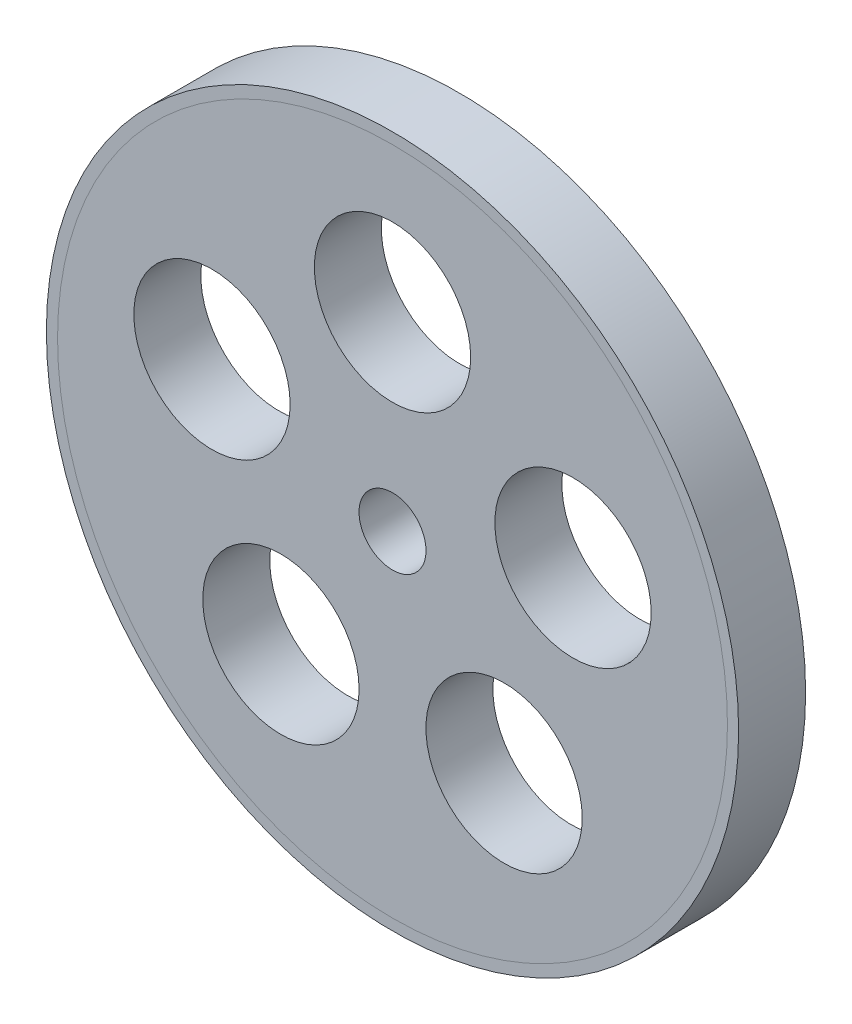
ISO-10303-21;
HEADER;
FILE_DESCRIPTION(('STEP AP214'),'2;1');
FILE_NAME('part.step','',(''),(''),'','','');
FILE_SCHEMA(('AUTOMOTIVE_DESIGN { 1 0 10303 214 1 1 1 1 }'));
ENDSEC;
DATA;
#1=APPLICATION_CONTEXT('core data for automotive mechanical design processes');
#2=APPLICATION_PROTOCOL_DEFINITION('international standard','automotive_design',2000,#1);
#3=PRODUCT_CONTEXT('',#1,'mechanical');
#4=PRODUCT('Part','Part','',(#3));
#5=PRODUCT_RELATED_PRODUCT_CATEGORY('part','',(#4));
#6=PRODUCT_DEFINITION_FORMATION('','',#4);
#7=PRODUCT_DEFINITION_CONTEXT('part definition',#1,'design');
#8=PRODUCT_DEFINITION('design','',#6,#7);
#9=PRODUCT_DEFINITION_SHAPE('','',#8);
#10=(LENGTH_UNIT() NAMED_UNIT(*) SI_UNIT(.MILLI.,.METRE.));
#11=(NAMED_UNIT(*) PLANE_ANGLE_UNIT() SI_UNIT($,.RADIAN.));
#12=(NAMED_UNIT(*) SI_UNIT($,.STERADIAN.) SOLID_ANGLE_UNIT());
#13=UNCERTAINTY_MEASURE_WITH_UNIT(LENGTH_MEASURE(1.E-05),#10,'distance_accuracy_value','');
#14=(GEOMETRIC_REPRESENTATION_CONTEXT(3) GLOBAL_UNCERTAINTY_ASSIGNED_CONTEXT((#13)) GLOBAL_UNIT_ASSIGNED_CONTEXT((#10,
#11,#12)) REPRESENTATION_CONTEXT('',''));
#15=CARTESIAN_POINT('',(0.,0.,0.));
#16=DIRECTION('',(0.,0.,1.));
#17=DIRECTION('',(1.,0.,0.));
#18=AXIS2_PLACEMENT_3D('',#15,#16,#17);
#19=CARTESIAN_POINT('',(0.,0.,0.));
#20=DIRECTION('',(0.,0.,-1.));
#21=DIRECTION('',(-1.,0.,0.));
#22=AXIS2_PLACEMENT_3D('',#19,#20,#21);
#23=CYLINDRICAL_SURFACE('',#22,15.);
#24=CARTESIAN_POINT('',(0.,0.,0.));
#25=DIRECTION('',(0.,0.,-1.));
#26=DIRECTION('',(-1.,0.,0.));
#27=AXIS2_PLACEMENT_3D('',#24,#25,#26);
#28=CIRCLE('',#27,15.);
#29=CARTESIAN_POINT('',(-15.,0.,0.));
#30=VERTEX_POINT('',#29);
#31=EDGE_CURVE('E59',#30,#30,#28,.T.);
#32=ORIENTED_EDGE('',*,*,#31,.T.);
#33=EDGE_LOOP('',(#32));
#34=FACE_BOUND('',#33,.T.);
#35=CARTESIAN_POINT('',(0.,0.,3.));
#36=DIRECTION('',(0.,0.,-1.));
#37=DIRECTION('',(-1.,0.,0.));
#38=AXIS2_PLACEMENT_3D('',#35,#36,#37);
#39=CIRCLE('',#38,15.);
#40=CARTESIAN_POINT('',(-15.,0.,3.));
#41=VERTEX_POINT('',#40);
#42=EDGE_CURVE('E11',#41,#41,#39,.T.);
#43=ORIENTED_EDGE('',*,*,#42,.F.);
#44=EDGE_LOOP('',(#43));
#45=FACE_BOUND('',#44,.T.);
#46=ADVANCED_FACE('F45',(#34,#45),#23,.F.);
#47=CARTESIAN_POINT('',(-15.,0.,3.));
#48=DIRECTION('',(0.,0.,1.));
#49=DIRECTION('',(1.,0.,0.));
#50=AXIS2_PLACEMENT_3D('',#47,#48,#49);
#51=PLANE('',#50);
#52=ORIENTED_EDGE('',*,*,#42,.T.);
#53=EDGE_LOOP('',(#52));
#54=FACE_BOUND('',#53,.T.);
#55=CARTESIAN_POINT('',(0.,0.,3.));
#56=DIRECTION('',(0.,0.,-1.));
#57=DIRECTION('',(-1.,0.,0.));
#58=AXIS2_PLACEMENT_3D('',#55,#56,#57);
#59=CIRCLE('',#58,15.5);
#60=CARTESIAN_POINT('',(-15.5,0.,3.));
#61=VERTEX_POINT('',#60);
#62=EDGE_CURVE('E51',#61,#61,#59,.T.);
#63=ORIENTED_EDGE('',*,*,#62,.F.);
#64=EDGE_LOOP('',(#63));
#65=FACE_BOUND('',#64,.T.);
#66=ADVANCED_FACE('F75',(#54,#65),#51,.T.);
#67=CARTESIAN_POINT('',(0.,0.,0.));
#68=DIRECTION('',(0.,0.,-1.));
#69=DIRECTION('',(-1.,0.,0.));
#70=AXIS2_PLACEMENT_3D('',#67,#68,#69);
#71=CYLINDRICAL_SURFACE('',#70,15.5);
#72=ORIENTED_EDGE('',*,*,#62,.T.);
#73=EDGE_LOOP('',(#72));
#74=FACE_BOUND('',#73,.T.);
#75=CARTESIAN_POINT('',(0.,0.,0.));
#76=DIRECTION('',(0.,0.,-1.));
#77=DIRECTION('',(-1.,0.,0.));
#78=AXIS2_PLACEMENT_3D('',#75,#76,#77);
#79=CIRCLE('',#78,15.5);
#80=CARTESIAN_POINT('',(-15.5,0.,0.));
#81=VERTEX_POINT('',#80);
#82=EDGE_CURVE('E55',#81,#81,#79,.T.);
#83=ORIENTED_EDGE('',*,*,#82,.F.);
#84=EDGE_LOOP('',(#83));
#85=FACE_BOUND('',#84,.T.);
#86=ADVANCED_FACE('F69',(#74,#85),#71,.T.);
#87=CARTESIAN_POINT('',(-15.,0.,0.));
#88=DIRECTION('',(0.,0.,-1.));
#89=DIRECTION('',(-1.,0.,0.));
#90=AXIS2_PLACEMENT_3D('',#87,#88,#89);
#91=PLANE('',#90);
#92=ORIENTED_EDGE('',*,*,#82,.T.);
#93=EDGE_LOOP('',(#92));
#94=FACE_BOUND('',#93,.T.);
#95=ORIENTED_EDGE('',*,*,#31,.F.);
#96=EDGE_LOOP('',(#95));
#97=FACE_BOUND('',#96,.T.);
#98=ADVANCED_FACE('F67',(#94,#97),#91,.T.);
#99=CLOSED_SHELL('',(#46,#66,#86,#98));
#100=MANIFOLD_SOLID_BREP('B2',#99);
#101=CARTESIAN_POINT('',(0.,0.,3.));
#102=DIRECTION('',(0.,0.,1.));
#103=DIRECTION('',(1.,0.,0.));
#104=AXIS2_PLACEMENT_3D('',#101,#102,#103);
#105=PLANE('',#104);
#106=CARTESIAN_POINT('',(4.99617464448831,-6.87664445218631,3.));
#107=DIRECTION('',(0.,0.,1.));
#108=DIRECTION('',(1.,0.,0.));
#109=AXIS2_PLACEMENT_3D('',#106,#107,#108);
#110=CIRCLE('',#109,3.50000000000202);
#111=CARTESIAN_POINT('',(8.49617464449033,-6.87664445218631,3.));
#112=VERTEX_POINT('',#111);
#113=EDGE_CURVE('E125',#112,#112,#110,.T.);
#114=ORIENTED_EDGE('',*,*,#113,.F.);
#115=EDGE_LOOP('',(#114));
#116=FACE_BOUND('',#115,.T.);
#117=CARTESIAN_POINT('',(-4.99617464448373,-6.8766444521878,3.));
#118=DIRECTION('',(0.,0.,1.));
#119=DIRECTION('',(1.,0.,0.));
#120=AXIS2_PLACEMENT_3D('',#117,#118,#119);
#121=CIRCLE('',#120,3.50000000000248);
#122=CARTESIAN_POINT('',(-1.49617464448125,-6.8766444521878,3.));
#123=VERTEX_POINT('',#122);
#124=EDGE_CURVE('E132',#123,#123,#121,.T.);
#125=ORIENTED_EDGE('',*,*,#124,.F.);
#126=EDGE_LOOP('',(#125));
#127=FACE_BOUND('',#126,.T.);
#128=CARTESIAN_POINT('',(-8.08398038850793,2.62664445218585,3.));
#129=DIRECTION('',(0.,0.,1.));
#130=DIRECTION('',(1.,0.,0.));
#131=AXIS2_PLACEMENT_3D('',#128,#129,#130);
#132=CIRCLE('',#131,3.50000000000128);
#133=CARTESIAN_POINT('',(-4.58398038850665,2.62664445218585,3.));
#134=VERTEX_POINT('',#133);
#135=EDGE_CURVE('E136',#134,#134,#132,.T.);
#136=ORIENTED_EDGE('',*,*,#135,.F.);
#137=EDGE_LOOP('',(#136));
#138=FACE_BOUND('',#137,.T.);
#139=CARTESIAN_POINT('',(0.,8.5,3.));
#140=DIRECTION('',(0.,0.,1.));
#141=DIRECTION('',(1.,0.,0.));
#142=AXIS2_PLACEMENT_3D('',#139,#140,#141);
#143=CIRCLE('',#142,3.5);
#144=CARTESIAN_POINT('',(3.5,8.5,3.));
#145=VERTEX_POINT('',#144);
#146=EDGE_CURVE('E140',#145,#145,#143,.T.);
#147=ORIENTED_EDGE('',*,*,#146,.F.);
#148=EDGE_LOOP('',(#147));
#149=FACE_BOUND('',#148,.T.);
#150=CARTESIAN_POINT('',(8.08398038850968,2.62664445218826,3.));
#151=DIRECTION('',(0.,0.,1.));
#152=DIRECTION('',(1.,0.,0.));
#153=AXIS2_PLACEMENT_3D('',#150,#151,#152);
#154=CIRCLE('',#153,3.50000000000051);
#155=CARTESIAN_POINT('',(11.5839803885102,2.62664445218826,3.));
#156=VERTEX_POINT('',#155);
#157=EDGE_CURVE('E144',#156,#156,#154,.T.);
#158=ORIENTED_EDGE('',*,*,#157,.F.);
#159=EDGE_LOOP('',(#158));
#160=FACE_BOUND('',#159,.T.);
#161=CARTESIAN_POINT('',(0.,0.,3.));
#162=DIRECTION('',(0.,0.,1.));
#163=DIRECTION('',(1.,0.,0.));
#164=AXIS2_PLACEMENT_3D('',#161,#162,#163);
#165=CIRCLE('',#164,15.);
#166=CARTESIAN_POINT('',(15.,0.,3.));
#167=VERTEX_POINT('',#166);
#168=EDGE_CURVE('E44',#167,#167,#165,.T.);
#169=ORIENTED_EDGE('',*,*,#168,.T.);
#170=EDGE_LOOP('',(#169));
#171=FACE_BOUND('',#170,.T.);
#172=CARTESIAN_POINT('',(0.,0.,3.));
#173=DIRECTION('',(0.,0.,1.));
#174=DIRECTION('',(1.,0.,0.));
#175=AXIS2_PLACEMENT_3D('',#172,#173,#174);
#176=CIRCLE('',#175,1.5);
#177=CARTESIAN_POINT('',(1.5,0.,3.));
#178=VERTEX_POINT('',#177);
#179=EDGE_CURVE('E119',#178,#178,#176,.T.);
#180=ORIENTED_EDGE('',*,*,#179,.F.);
#181=EDGE_LOOP('',(#180));
#182=FACE_BOUND('',#181,.T.);
#183=ADVANCED_FACE('F106',(#116,#127,#138,#149,#160,#171,#182),#105,.T.);
#184=CARTESIAN_POINT('',(0.,0.,0.));
#185=DIRECTION('',(0.,0.,1.));
#186=DIRECTION('',(1.,0.,0.));
#187=AXIS2_PLACEMENT_3D('',#184,#185,#186);
#188=PLANE('',#187);
#189=CARTESIAN_POINT('',(4.99617464448831,-6.87664445218631,0.));
#190=DIRECTION('',(0.,0.,1.));
#191=DIRECTION('',(1.,0.,0.));
#192=AXIS2_PLACEMENT_3D('',#189,#190,#191);
#193=CIRCLE('',#192,3.50000000000202);
#194=CARTESIAN_POINT('',(8.49617464449033,-6.87664445218631,0.));
#195=VERTEX_POINT('',#194);
#196=EDGE_CURVE('E153',#195,#195,#193,.T.);
#197=ORIENTED_EDGE('',*,*,#196,.T.);
#198=EDGE_LOOP('',(#197));
#199=FACE_BOUND('',#198,.T.);
#200=CARTESIAN_POINT('',(-4.99617464448373,-6.8766444521878,0.));
#201=DIRECTION('',(0.,0.,1.));
#202=DIRECTION('',(1.,0.,0.));
#203=AXIS2_PLACEMENT_3D('',#200,#201,#202);
#204=CIRCLE('',#203,3.50000000000248);
#205=CARTESIAN_POINT('',(-1.49617464448125,-6.8766444521878,0.));
#206=VERTEX_POINT('',#205);
#207=EDGE_CURVE('E157',#206,#206,#204,.T.);
#208=ORIENTED_EDGE('',*,*,#207,.T.);
#209=EDGE_LOOP('',(#208));
#210=FACE_BOUND('',#209,.T.);
#211=CARTESIAN_POINT('',(-8.08398038850793,2.62664445218585,0.));
#212=DIRECTION('',(0.,0.,1.));
#213=DIRECTION('',(1.,0.,0.));
#214=AXIS2_PLACEMENT_3D('',#211,#212,#213);
#215=CIRCLE('',#214,3.50000000000128);
#216=CARTESIAN_POINT('',(-4.58398038850665,2.62664445218585,0.));
#217=VERTEX_POINT('',#216);
#218=EDGE_CURVE('E161',#217,#217,#215,.T.);
#219=ORIENTED_EDGE('',*,*,#218,.T.);
#220=EDGE_LOOP('',(#219));
#221=FACE_BOUND('',#220,.T.);
#222=CARTESIAN_POINT('',(0.,8.5,0.));
#223=DIRECTION('',(0.,0.,1.));
#224=DIRECTION('',(1.,0.,0.));
#225=AXIS2_PLACEMENT_3D('',#222,#223,#224);
#226=CIRCLE('',#225,3.5);
#227=CARTESIAN_POINT('',(3.5,8.5,0.));
#228=VERTEX_POINT('',#227);
#229=EDGE_CURVE('E152',#228,#228,#226,.T.);
#230=ORIENTED_EDGE('',*,*,#229,.T.);
#231=EDGE_LOOP('',(#230));
#232=FACE_BOUND('',#231,.T.);
#233=CARTESIAN_POINT('',(8.08398038850968,2.62664445218826,0.));
#234=DIRECTION('',(0.,0.,1.));
#235=DIRECTION('',(1.,0.,0.));
#236=AXIS2_PLACEMENT_3D('',#233,#234,#235);
#237=CIRCLE('',#236,3.50000000000051);
#238=CARTESIAN_POINT('',(11.5839803885102,2.62664445218826,0.));
#239=VERTEX_POINT('',#238);
#240=EDGE_CURVE('E148',#239,#239,#237,.T.);
#241=ORIENTED_EDGE('',*,*,#240,.T.);
#242=EDGE_LOOP('',(#241));
#243=FACE_BOUND('',#242,.T.);
#244=CARTESIAN_POINT('',(0.,0.,0.));
#245=DIRECTION('',(0.,0.,1.));
#246=DIRECTION('',(1.,0.,0.));
#247=AXIS2_PLACEMENT_3D('',#244,#245,#246);
#248=CIRCLE('',#247,15.);
#249=CARTESIAN_POINT('',(15.,0.,0.));
#250=VERTEX_POINT('',#249);
#251=EDGE_CURVE('E110',#250,#250,#248,.T.);
#252=ORIENTED_EDGE('',*,*,#251,.F.);
#253=EDGE_LOOP('',(#252));
#254=FACE_BOUND('',#253,.T.);
#255=CARTESIAN_POINT('',(0.,0.,0.));
#256=DIRECTION('',(0.,0.,1.));
#257=DIRECTION('',(1.,0.,0.));
#258=AXIS2_PLACEMENT_3D('',#255,#256,#257);
#259=CIRCLE('',#258,1.5);
#260=CARTESIAN_POINT('',(1.5,0.,0.));
#261=VERTEX_POINT('',#260);
#262=EDGE_CURVE('E121',#261,#261,#259,.T.);
#263=ORIENTED_EDGE('',*,*,#262,.T.);
#264=EDGE_LOOP('',(#263));
#265=FACE_BOUND('',#264,.T.);
#266=ADVANCED_FACE('F169',(#199,#210,#221,#232,#243,#254,#265),#188,.F.);
#267=CARTESIAN_POINT('',(0.,0.,3.));
#268=DIRECTION('',(0.,0.,-1.));
#269=DIRECTION('',(-1.,0.,0.));
#270=AXIS2_PLACEMENT_3D('',#267,#268,#269);
#271=CYLINDRICAL_SURFACE('',#270,15.);
#272=ORIENTED_EDGE('',*,*,#168,.F.);
#273=EDGE_LOOP('',(#272));
#274=FACE_BOUND('',#273,.T.);
#275=ORIENTED_EDGE('',*,*,#251,.T.);
#276=EDGE_LOOP('',(#275));
#277=FACE_BOUND('',#276,.T.);
#278=ADVANCED_FACE('F108',(#274,#277),#271,.T.);
#279=CARTESIAN_POINT('',(0.,0.,3.));
#280=DIRECTION('',(0.,0.,-1.));
#281=DIRECTION('',(-1.,0.,0.));
#282=AXIS2_PLACEMENT_3D('',#279,#280,#281);
#283=CYLINDRICAL_SURFACE('',#282,1.5);
#284=ORIENTED_EDGE('',*,*,#179,.T.);
#285=EDGE_LOOP('',(#284));
#286=FACE_BOUND('',#285,.T.);
#287=ORIENTED_EDGE('',*,*,#262,.F.);
#288=EDGE_LOOP('',(#287));
#289=FACE_BOUND('',#288,.T.);
#290=ADVANCED_FACE('F185',(#286,#289),#283,.F.);
#291=CARTESIAN_POINT('',(8.08398038850968,2.62664445218826,0.));
#292=DIRECTION('',(0.,0.,1.));
#293=DIRECTION('',(1.,0.,0.));
#294=AXIS2_PLACEMENT_3D('',#291,#292,#293);
#295=CYLINDRICAL_SURFACE('',#294,3.50000000000051);
#296=ORIENTED_EDGE('',*,*,#157,.T.);
#297=EDGE_LOOP('',(#296));
#298=FACE_BOUND('',#297,.T.);
#299=ORIENTED_EDGE('',*,*,#240,.F.);
#300=EDGE_LOOP('',(#299));
#301=FACE_BOUND('',#300,.T.);
#302=ADVANCED_FACE('F175',(#298,#301),#295,.F.);
#303=CARTESIAN_POINT('',(0.,8.5,0.));
#304=DIRECTION('',(0.,0.,1.));
#305=DIRECTION('',(1.,0.,0.));
#306=AXIS2_PLACEMENT_3D('',#303,#304,#305);
#307=CYLINDRICAL_SURFACE('',#306,3.5);
#308=ORIENTED_EDGE('',*,*,#146,.T.);
#309=EDGE_LOOP('',(#308));
#310=FACE_BOUND('',#309,.T.);
#311=ORIENTED_EDGE('',*,*,#229,.F.);
#312=EDGE_LOOP('',(#311));
#313=FACE_BOUND('',#312,.T.);
#314=ADVANCED_FACE('F172',(#310,#313),#307,.F.);
#315=CARTESIAN_POINT('',(-8.08398038850793,2.62664445218585,0.));
#316=DIRECTION('',(0.,0.,1.));
#317=DIRECTION('',(1.,0.,0.));
#318=AXIS2_PLACEMENT_3D('',#315,#316,#317);
#319=CYLINDRICAL_SURFACE('',#318,3.50000000000128);
#320=ORIENTED_EDGE('',*,*,#135,.T.);
#321=EDGE_LOOP('',(#320));
#322=FACE_BOUND('',#321,.T.);
#323=ORIENTED_EDGE('',*,*,#218,.F.);
#324=EDGE_LOOP('',(#323));
#325=FACE_BOUND('',#324,.T.);
#326=ADVANCED_FACE('F174',(#322,#325),#319,.F.);
#327=CARTESIAN_POINT('',(-4.99617464448373,-6.8766444521878,0.));
#328=DIRECTION('',(0.,0.,1.));
#329=DIRECTION('',(1.,0.,0.));
#330=AXIS2_PLACEMENT_3D('',#327,#328,#329);
#331=CYLINDRICAL_SURFACE('',#330,3.50000000000248);
#332=ORIENTED_EDGE('',*,*,#124,.T.);
#333=EDGE_LOOP('',(#332));
#334=FACE_BOUND('',#333,.T.);
#335=ORIENTED_EDGE('',*,*,#207,.F.);
#336=EDGE_LOOP('',(#335));
#337=FACE_BOUND('',#336,.T.);
#338=ADVANCED_FACE('F182',(#334,#337),#331,.F.);
#339=CARTESIAN_POINT('',(4.99617464448831,-6.87664445218631,0.));
#340=DIRECTION('',(0.,0.,1.));
#341=DIRECTION('',(1.,0.,0.));
#342=AXIS2_PLACEMENT_3D('',#339,#340,#341);
#343=CYLINDRICAL_SURFACE('',#342,3.50000000000202);
#344=ORIENTED_EDGE('',*,*,#113,.T.);
#345=EDGE_LOOP('',(#344));
#346=FACE_BOUND('',#345,.T.);
#347=ORIENTED_EDGE('',*,*,#196,.F.);
#348=EDGE_LOOP('',(#347));
#349=FACE_BOUND('',#348,.T.);
#350=ADVANCED_FACE('F202',(#346,#349),#343,.F.);
#351=CLOSED_SHELL('',(#183,#266,#278,#290,#302,#314,#326,#338,#350));
#352=MANIFOLD_SOLID_BREP('B6',#351);
#353=ADVANCED_BREP_SHAPE_REPRESENTATION('',(#18,#100,#352),#14);
#354=SHAPE_DEFINITION_REPRESENTATION(#9,#353);
ENDSEC;
END-ISO-10303-21;
